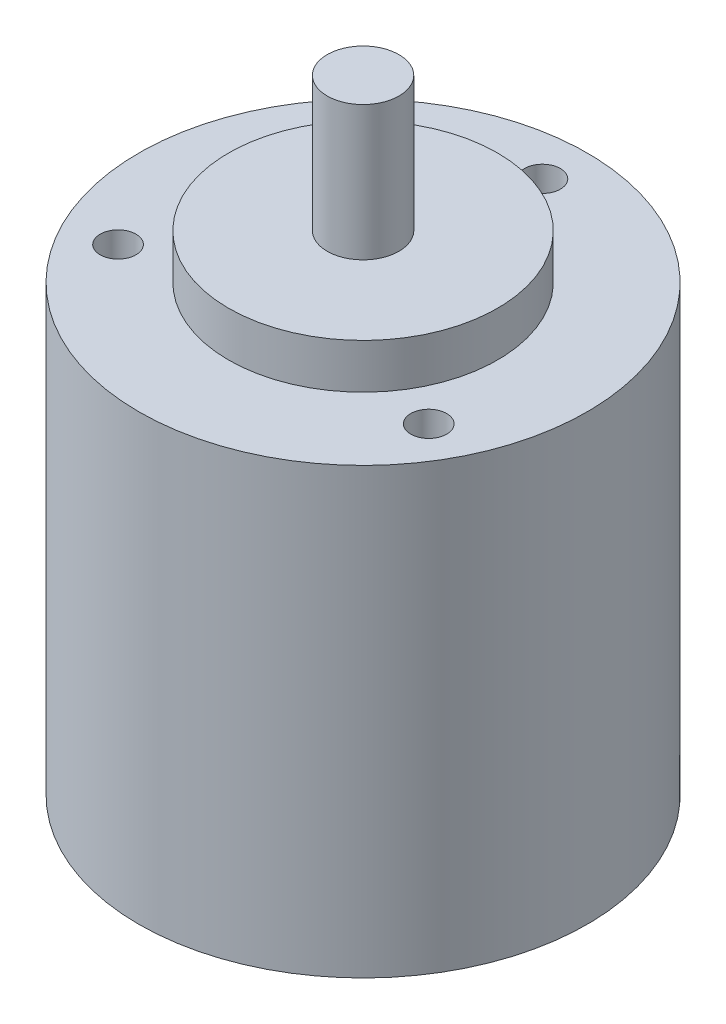
ISO-10303-21;
HEADER;
FILE_DESCRIPTION(('STEP AP214'),'2;1');
FILE_NAME('part.step','',(''),(''),'','','');
FILE_SCHEMA(('AUTOMOTIVE_DESIGN { 1 0 10303 214 1 1 1 1 }'));
ENDSEC;
DATA;
#1=APPLICATION_CONTEXT('core data for automotive mechanical design processes');
#2=APPLICATION_PROTOCOL_DEFINITION('international standard','automotive_design',2000,#1);
#3=PRODUCT_CONTEXT('',#1,'mechanical');
#4=PRODUCT('Part','Part','',(#3));
#5=PRODUCT_RELATED_PRODUCT_CATEGORY('part','',(#4));
#6=PRODUCT_DEFINITION_FORMATION('','',#4);
#7=PRODUCT_DEFINITION_CONTEXT('part definition',#1,'design');
#8=PRODUCT_DEFINITION('design','',#6,#7);
#9=PRODUCT_DEFINITION_SHAPE('','',#8);
#10=(LENGTH_UNIT() NAMED_UNIT(*) SI_UNIT(.MILLI.,.METRE.));
#11=(NAMED_UNIT(*) PLANE_ANGLE_UNIT() SI_UNIT($,.RADIAN.));
#12=(NAMED_UNIT(*) SI_UNIT($,.STERADIAN.) SOLID_ANGLE_UNIT());
#13=UNCERTAINTY_MEASURE_WITH_UNIT(LENGTH_MEASURE(1.E-05),#10,'distance_accuracy_value','');
#14=(GEOMETRIC_REPRESENTATION_CONTEXT(3) GLOBAL_UNCERTAINTY_ASSIGNED_CONTEXT((#13)) GLOBAL_UNIT_ASSIGNED_CONTEXT((#10,
#11,#12)) REPRESENTATION_CONTEXT('',''));
#15=CARTESIAN_POINT('',(0.,0.,0.));
#16=DIRECTION('',(0.,0.,1.));
#17=DIRECTION('',(1.,0.,0.));
#18=AXIS2_PLACEMENT_3D('',#15,#16,#17);
#19=CARTESIAN_POINT('',(0.,49.5,0.));
#20=DIRECTION('',(0.,-1.,0.));
#21=DIRECTION('',(0.,0.,-1.));
#22=AXIS2_PLACEMENT_3D('',#19,#20,#21);
#23=CYLINDRICAL_SURFACE('',#22,25.);
#24=CARTESIAN_POINT('',(0.,49.5,0.));
#25=DIRECTION('',(0.,1.,0.));
#26=DIRECTION('',(0.,0.,1.));
#27=AXIS2_PLACEMENT_3D('',#24,#25,#26);
#28=CIRCLE('',#27,25.);
#29=CARTESIAN_POINT('',(0.,49.5,25.));
#30=VERTEX_POINT('',#29);
#31=EDGE_CURVE('E43',#30,#30,#28,.T.);
#32=ORIENTED_EDGE('',*,*,#31,.F.);
#33=EDGE_LOOP('',(#32));
#34=FACE_BOUND('',#33,.T.);
#35=CARTESIAN_POINT('',(0.,0.,0.));
#36=DIRECTION('',(0.,1.,0.));
#37=DIRECTION('',(0.,0.,1.));
#38=AXIS2_PLACEMENT_3D('',#35,#36,#37);
#39=CIRCLE('',#38,25.);
#40=CARTESIAN_POINT('',(0.,0.,25.));
#41=VERTEX_POINT('',#40);
#42=EDGE_CURVE('E34',#41,#41,#39,.T.);
#43=ORIENTED_EDGE('',*,*,#42,.T.);
#44=EDGE_LOOP('',(#43));
#45=FACE_BOUND('',#44,.T.);
#46=ADVANCED_FACE('F31',(#34,#45),#23,.T.);
#47=CARTESIAN_POINT('',(0.,49.5,0.));
#48=DIRECTION('',(0.,1.,0.));
#49=DIRECTION('',(0.,0.,1.));
#50=AXIS2_PLACEMENT_3D('',#47,#48,#49);
#51=PLANE('',#50);
#52=CARTESIAN_POINT('',(0.,49.5,-20.));
#53=DIRECTION('',(0.,1.,0.));
#54=DIRECTION('',(0.,0.,1.));
#55=AXIS2_PLACEMENT_3D('',#52,#53,#54);
#56=CIRCLE('',#55,2.);
#57=CARTESIAN_POINT('',(0.,49.5,-18.));
#58=VERTEX_POINT('',#57);
#59=EDGE_CURVE('E191',#58,#58,#56,.T.);
#60=ORIENTED_EDGE('',*,*,#59,.F.);
#61=EDGE_LOOP('',(#60));
#62=FACE_BOUND('',#61,.T.);
#63=CARTESIAN_POINT('',(17.3205080756888,49.5,10.));
#64=DIRECTION('',(0.,1.,0.));
#65=DIRECTION('',(0.,0.,1.));
#66=AXIS2_PLACEMENT_3D('',#63,#64,#65);
#67=CIRCLE('',#66,2.);
#68=CARTESIAN_POINT('',(17.3205080756888,49.5,12.));
#69=VERTEX_POINT('',#68);
#70=EDGE_CURVE('E200',#69,#69,#67,.T.);
#71=ORIENTED_EDGE('',*,*,#70,.F.);
#72=EDGE_LOOP('',(#71));
#73=FACE_BOUND('',#72,.T.);
#74=CARTESIAN_POINT('',(-17.3205080756888,49.5,10.));
#75=DIRECTION('',(0.,1.,0.));
#76=DIRECTION('',(0.,0.,1.));
#77=AXIS2_PLACEMENT_3D('',#74,#75,#76);
#78=CIRCLE('',#77,2.);
#79=CARTESIAN_POINT('',(-17.3205080756888,49.5,12.));
#80=VERTEX_POINT('',#79);
#81=EDGE_CURVE('E205',#80,#80,#78,.T.);
#82=ORIENTED_EDGE('',*,*,#81,.F.);
#83=EDGE_LOOP('',(#82));
#84=FACE_BOUND('',#83,.T.);
#85=CARTESIAN_POINT('',(0.,49.5,0.));
#86=DIRECTION('',(0.,1.,0.));
#87=DIRECTION('',(0.,0.,1.));
#88=AXIS2_PLACEMENT_3D('',#85,#86,#87);
#89=CIRCLE('',#88,15.);
#90=CARTESIAN_POINT('',(0.,49.5,15.));
#91=VERTEX_POINT('',#90);
#92=EDGE_CURVE('E38',#91,#91,#89,.T.);
#93=ORIENTED_EDGE('',*,*,#92,.F.);
#94=EDGE_LOOP('',(#93));
#95=FACE_BOUND('',#94,.T.);
#96=ORIENTED_EDGE('',*,*,#31,.T.);
#97=EDGE_LOOP('',(#96));
#98=FACE_BOUND('',#97,.T.);
#99=ADVANCED_FACE('F61',(#62,#73,#84,#95,#98),#51,.T.);
#100=CARTESIAN_POINT('',(0.,0.,0.));
#101=DIRECTION('',(0.,1.,0.));
#102=DIRECTION('',(0.,0.,1.));
#103=AXIS2_PLACEMENT_3D('',#100,#101,#102);
#104=PLANE('',#103);
#105=ORIENTED_EDGE('',*,*,#42,.F.);
#106=EDGE_LOOP('',(#105));
#107=FACE_BOUND('',#106,.T.);
#108=ADVANCED_FACE('F58',(#107),#104,.F.);
#109=CARTESIAN_POINT('',(0.,54.5,0.));
#110=DIRECTION('',(0.,-1.,0.));
#111=DIRECTION('',(0.,0.,-1.));
#112=AXIS2_PLACEMENT_3D('',#109,#110,#111);
#113=CYLINDRICAL_SURFACE('',#112,15.);
#114=CARTESIAN_POINT('',(0.,54.5,0.));
#115=DIRECTION('',(0.,1.,0.));
#116=DIRECTION('',(0.,0.,1.));
#117=AXIS2_PLACEMENT_3D('',#114,#115,#116);
#118=CIRCLE('',#117,15.);
#119=CARTESIAN_POINT('',(0.,54.5,15.));
#120=VERTEX_POINT('',#119);
#121=EDGE_CURVE('E49',#120,#120,#118,.T.);
#122=ORIENTED_EDGE('',*,*,#121,.F.);
#123=EDGE_LOOP('',(#122));
#124=FACE_BOUND('',#123,.T.);
#125=ORIENTED_EDGE('',*,*,#92,.T.);
#126=EDGE_LOOP('',(#125));
#127=FACE_BOUND('',#126,.T.);
#128=ADVANCED_FACE('F60',(#124,#127),#113,.T.);
#129=CARTESIAN_POINT('',(0.,54.5,0.));
#130=DIRECTION('',(0.,1.,0.));
#131=DIRECTION('',(0.,0.,1.));
#132=AXIS2_PLACEMENT_3D('',#129,#130,#131);
#133=PLANE('',#132);
#134=CARTESIAN_POINT('',(0.,54.5,0.));
#135=DIRECTION('',(0.,1.,0.));
#136=DIRECTION('',(0.,0.,1.));
#137=AXIS2_PLACEMENT_3D('',#134,#135,#136);
#138=CIRCLE('',#137,4.);
#139=CARTESIAN_POINT('',(0.,54.5,4.));
#140=VERTEX_POINT('',#139);
#141=EDGE_CURVE('E10',#140,#140,#138,.T.);
#142=ORIENTED_EDGE('',*,*,#141,.F.);
#143=EDGE_LOOP('',(#142));
#144=FACE_BOUND('',#143,.T.);
#145=ORIENTED_EDGE('',*,*,#121,.T.);
#146=EDGE_LOOP('',(#145));
#147=FACE_BOUND('',#146,.T.);
#148=ADVANCED_FACE('F66',(#144,#147),#133,.T.);
#149=CARTESIAN_POINT('',(0.,69.5,0.));
#150=DIRECTION('',(0.,-1.,0.));
#151=DIRECTION('',(0.,0.,-1.));
#152=AXIS2_PLACEMENT_3D('',#149,#150,#151);
#153=CYLINDRICAL_SURFACE('',#152,4.);
#154=CARTESIAN_POINT('',(0.,69.5,0.));
#155=DIRECTION('',(0.,1.,0.));
#156=DIRECTION('',(0.,0.,1.));
#157=AXIS2_PLACEMENT_3D('',#154,#155,#156);
#158=CIRCLE('',#157,4.);
#159=CARTESIAN_POINT('',(0.,69.5,4.));
#160=VERTEX_POINT('',#159);
#161=EDGE_CURVE('E47',#160,#160,#158,.T.);
#162=ORIENTED_EDGE('',*,*,#161,.F.);
#163=EDGE_LOOP('',(#162));
#164=FACE_BOUND('',#163,.T.);
#165=ORIENTED_EDGE('',*,*,#141,.T.);
#166=EDGE_LOOP('',(#165));
#167=FACE_BOUND('',#166,.T.);
#168=ADVANCED_FACE('F153',(#164,#167),#153,.T.);
#169=CARTESIAN_POINT('',(0.,69.5,0.));
#170=DIRECTION('',(0.,1.,0.));
#171=DIRECTION('',(0.,0.,1.));
#172=AXIS2_PLACEMENT_3D('',#169,#170,#171);
#173=PLANE('',#172);
#174=ORIENTED_EDGE('',*,*,#161,.T.);
#175=EDGE_LOOP('',(#174));
#176=FACE_BOUND('',#175,.T.);
#177=ADVANCED_FACE('F86',(#176),#173,.T.);
#178=CARTESIAN_POINT('',(-17.3205080756888,39.5,10.));
#179=DIRECTION('',(0.,1.,0.));
#180=DIRECTION('',(0.,0.,1.));
#181=AXIS2_PLACEMENT_3D('',#178,#179,#180);
#182=CYLINDRICAL_SURFACE('',#181,2.);
#183=CARTESIAN_POINT('',(-17.3205080756888,39.5,10.));
#184=DIRECTION('',(0.,1.,0.));
#185=DIRECTION('',(0.,0.,1.));
#186=AXIS2_PLACEMENT_3D('',#183,#184,#185);
#187=CIRCLE('',#186,2.);
#188=CARTESIAN_POINT('',(-17.3205080756888,39.5,12.));
#189=VERTEX_POINT('',#188);
#190=EDGE_CURVE('E203',#189,#189,#187,.T.);
#191=ORIENTED_EDGE('',*,*,#190,.F.);
#192=EDGE_LOOP('',(#191));
#193=FACE_BOUND('',#192,.T.);
#194=ORIENTED_EDGE('',*,*,#81,.T.);
#195=EDGE_LOOP('',(#194));
#196=FACE_BOUND('',#195,.T.);
#197=ADVANCED_FACE('F91',(#193,#196),#182,.F.);
#198=CARTESIAN_POINT('',(-17.3205080756888,39.5,10.));
#199=DIRECTION('',(0.,1.,0.));
#200=DIRECTION('',(0.,0.,1.));
#201=AXIS2_PLACEMENT_3D('',#198,#199,#200);
#202=PLANE('',#201);
#203=ORIENTED_EDGE('',*,*,#190,.T.);
#204=EDGE_LOOP('',(#203));
#205=FACE_BOUND('',#204,.T.);
#206=ADVANCED_FACE('F96',(#205),#202,.T.);
#207=CARTESIAN_POINT('',(17.3205080756888,39.5,10.));
#208=DIRECTION('',(0.,1.,0.));
#209=DIRECTION('',(0.,0.,1.));
#210=AXIS2_PLACEMENT_3D('',#207,#208,#209);
#211=CYLINDRICAL_SURFACE('',#210,2.);
#212=CARTESIAN_POINT('',(17.3205080756888,39.5,10.));
#213=DIRECTION('',(0.,1.,0.));
#214=DIRECTION('',(0.,0.,1.));
#215=AXIS2_PLACEMENT_3D('',#212,#213,#214);
#216=CIRCLE('',#215,2.);
#217=CARTESIAN_POINT('',(17.3205080756888,39.5,12.));
#218=VERTEX_POINT('',#217);
#219=EDGE_CURVE('E195',#218,#218,#216,.T.);
#220=ORIENTED_EDGE('',*,*,#219,.F.);
#221=EDGE_LOOP('',(#220));
#222=FACE_BOUND('',#221,.T.);
#223=ORIENTED_EDGE('',*,*,#70,.T.);
#224=EDGE_LOOP('',(#223));
#225=FACE_BOUND('',#224,.T.);
#226=ADVANCED_FACE('F106',(#222,#225),#211,.F.);
#227=CARTESIAN_POINT('',(17.3205080756888,39.5,10.));
#228=DIRECTION('',(0.,1.,0.));
#229=DIRECTION('',(0.,0.,1.));
#230=AXIS2_PLACEMENT_3D('',#227,#228,#229);
#231=PLANE('',#230);
#232=ORIENTED_EDGE('',*,*,#219,.T.);
#233=EDGE_LOOP('',(#232));
#234=FACE_BOUND('',#233,.T.);
#235=ADVANCED_FACE('F116',(#234),#231,.T.);
#236=CARTESIAN_POINT('',(0.,39.5,-20.));
#237=DIRECTION('',(0.,1.,0.));
#238=DIRECTION('',(0.,0.,1.));
#239=AXIS2_PLACEMENT_3D('',#236,#237,#238);
#240=CYLINDRICAL_SURFACE('',#239,2.);
#241=CARTESIAN_POINT('',(0.,39.5,-20.));
#242=DIRECTION('',(0.,1.,0.));
#243=DIRECTION('',(0.,0.,1.));
#244=AXIS2_PLACEMENT_3D('',#241,#242,#243);
#245=CIRCLE('',#244,2.);
#246=CARTESIAN_POINT('',(0.,39.5,-18.));
#247=VERTEX_POINT('',#246);
#248=EDGE_CURVE('E190',#247,#247,#245,.T.);
#249=ORIENTED_EDGE('',*,*,#248,.F.);
#250=EDGE_LOOP('',(#249));
#251=FACE_BOUND('',#250,.T.);
#252=ORIENTED_EDGE('',*,*,#59,.T.);
#253=EDGE_LOOP('',(#252));
#254=FACE_BOUND('',#253,.T.);
#255=ADVANCED_FACE('F126',(#251,#254),#240,.F.);
#256=CARTESIAN_POINT('',(0.,39.5,-20.));
#257=DIRECTION('',(0.,1.,0.));
#258=DIRECTION('',(0.,0.,1.));
#259=AXIS2_PLACEMENT_3D('',#256,#257,#258);
#260=PLANE('',#259);
#261=ORIENTED_EDGE('',*,*,#248,.T.);
#262=EDGE_LOOP('',(#261));
#263=FACE_BOUND('',#262,.T.);
#264=ADVANCED_FACE('F136',(#263),#260,.T.);
#265=CLOSED_SHELL('',(#46,#99,#108,#128,#148,#168,#177,#197,#206,#226,#235,#255,#264));
#266=MANIFOLD_SOLID_BREP('B2',#265);
#267=ADVANCED_BREP_SHAPE_REPRESENTATION('',(#18,#266),#14);
#268=SHAPE_DEFINITION_REPRESENTATION(#9,#267);
ENDSEC;
END-ISO-10303-21;
